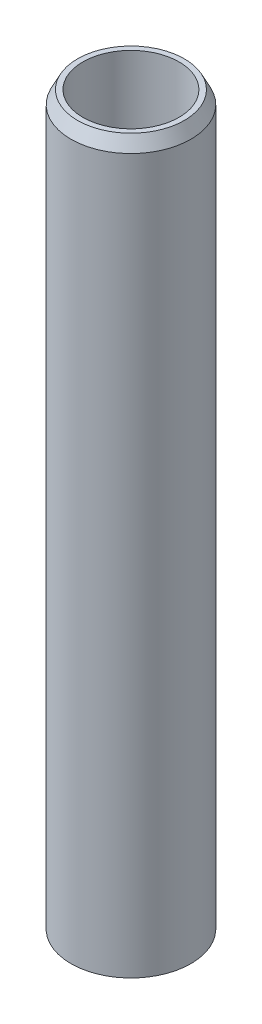
ISO-10303-21;
HEADER;
FILE_DESCRIPTION(('STEP AP214'),'2;1');
FILE_NAME('part.step','',(''),(''),'','','');
FILE_SCHEMA(('AUTOMOTIVE_DESIGN { 1 0 10303 214 1 1 1 1 }'));
ENDSEC;
DATA;
#1=APPLICATION_CONTEXT('core data for automotive mechanical design processes');
#2=APPLICATION_PROTOCOL_DEFINITION('international standard','automotive_design',2000,#1);
#3=PRODUCT_CONTEXT('',#1,'mechanical');
#4=PRODUCT('Part','Part','',(#3));
#5=PRODUCT_RELATED_PRODUCT_CATEGORY('part','',(#4));
#6=PRODUCT_DEFINITION_FORMATION('','',#4);
#7=PRODUCT_DEFINITION_CONTEXT('part definition',#1,'design');
#8=PRODUCT_DEFINITION('design','',#6,#7);
#9=PRODUCT_DEFINITION_SHAPE('','',#8);
#10=(LENGTH_UNIT() NAMED_UNIT(*) SI_UNIT(.MILLI.,.METRE.));
#11=(NAMED_UNIT(*) PLANE_ANGLE_UNIT() SI_UNIT($,.RADIAN.));
#12=(NAMED_UNIT(*) SI_UNIT($,.STERADIAN.) SOLID_ANGLE_UNIT());
#13=UNCERTAINTY_MEASURE_WITH_UNIT(LENGTH_MEASURE(1.E-05),#10,'distance_accuracy_value','');
#14=(GEOMETRIC_REPRESENTATION_CONTEXT(3) GLOBAL_UNCERTAINTY_ASSIGNED_CONTEXT((#13)) GLOBAL_UNIT_ASSIGNED_CONTEXT((#10,
#11,#12)) REPRESENTATION_CONTEXT('',''));
#15=CARTESIAN_POINT('',(0.,0.,0.));
#16=DIRECTION('',(0.,0.,1.));
#17=DIRECTION('',(1.,0.,0.));
#18=AXIS2_PLACEMENT_3D('',#15,#16,#17);
#19=CARTESIAN_POINT('',(0.,305.765995340014,0.));
#20=DIRECTION('',(0.,-1.,0.));
#21=DIRECTION('',(0.,0.,-1.));
#22=AXIS2_PLACEMENT_3D('',#19,#20,#21);
#23=CYLINDRICAL_SURFACE('',#22,25.);
#24=CARTESIAN_POINT('',(0.,300.345094666298,0.));
#25=DIRECTION('',(0.,1.,0.));
#26=DIRECTION('',(0.,0.,1.));
#27=AXIS2_PLACEMENT_3D('',#24,#25,#26);
#28=CIRCLE('',#27,25.);
#29=CARTESIAN_POINT('',(0.,300.345094666298,25.));
#30=VERTEX_POINT('',#29);
#31=EDGE_CURVE('E50',#30,#30,#28,.F.);
#32=ORIENTED_EDGE('',*,*,#31,.T.);
#33=EDGE_LOOP('',(#32));
#34=FACE_BOUND('',#33,.T.);
#35=CARTESIAN_POINT('',(0.,2.73585345812605,0.));
#36=DIRECTION('',(0.,1.,0.));
#37=DIRECTION('',(0.,0.,1.));
#38=AXIS2_PLACEMENT_3D('',#35,#36,#37);
#39=CIRCLE('',#38,25.);
#40=CARTESIAN_POINT('',(0.,2.73585345812605,25.));
#41=VERTEX_POINT('',#40);
#42=EDGE_CURVE('E51',#41,#41,#39,.T.);
#43=ORIENTED_EDGE('',*,*,#42,.T.);
#44=EDGE_LOOP('',(#43));
#45=FACE_BOUND('',#44,.T.);
#46=ADVANCED_FACE('F39',(#34,#45),#23,.T.);
#47=CARTESIAN_POINT('',(0.,305.765995340014,0.));
#48=DIRECTION('',(0.,1.,0.));
#49=DIRECTION('',(0.,0.,1.));
#50=AXIS2_PLACEMENT_3D('',#47,#48,#49);
#51=PLANE('',#50);
#52=CARTESIAN_POINT('',(0.,305.765995340014,0.));
#53=DIRECTION('',(0.,1.,0.));
#54=DIRECTION('',(0.,0.,1.));
#55=AXIS2_PLACEMENT_3D('',#52,#53,#54);
#56=CIRCLE('',#55,22.2641465418739);
#57=CARTESIAN_POINT('',(0.,305.765995340014,22.2641465418739));
#58=VERTEX_POINT('',#57);
#59=EDGE_CURVE('E54',#58,#58,#56,.T.);
#60=ORIENTED_EDGE('',*,*,#59,.T.);
#61=EDGE_LOOP('',(#60));
#62=FACE_BOUND('',#61,.T.);
#63=CARTESIAN_POINT('',(0.,305.765995340014,0.));
#64=DIRECTION('',(0.,1.,0.));
#65=DIRECTION('',(0.,0.,1.));
#66=AXIS2_PLACEMENT_3D('',#63,#64,#65);
#67=CIRCLE('',#66,20.0430833670544);
#68=CARTESIAN_POINT('',(0.,305.765995340014,20.0430833670544));
#69=VERTEX_POINT('',#68);
#70=EDGE_CURVE('E58',#69,#69,#67,.T.);
#71=ORIENTED_EDGE('',*,*,#70,.F.);
#72=EDGE_LOOP('',(#71));
#73=FACE_BOUND('',#72,.T.);
#74=ADVANCED_FACE('F68',(#62,#73),#51,.T.);
#75=CARTESIAN_POINT('',(0.,305.765995340014,0.));
#76=DIRECTION('',(0.,-1.,0.));
#77=DIRECTION('',(0.,0.,-1.));
#78=AXIS2_PLACEMENT_3D('',#75,#76,#77);
#79=CYLINDRICAL_SURFACE('',#78,20.0430833670544);
#80=CARTESIAN_POINT('',(0.,0.234166316422996,0.));
#81=DIRECTION('',(0.,1.,0.));
#82=DIRECTION('',(0.,0.,1.));
#83=AXIS2_PLACEMENT_3D('',#80,#81,#82);
#84=CIRCLE('',#83,20.0430833670544);
#85=CARTESIAN_POINT('',(0.,0.234166316422996,20.0430833670544));
#86=VERTEX_POINT('',#85);
#87=EDGE_CURVE('E10',#86,#86,#84,.F.);
#88=ORIENTED_EDGE('',*,*,#87,.T.);
#89=EDGE_LOOP('',(#88));
#90=FACE_BOUND('',#89,.T.);
#91=ORIENTED_EDGE('',*,*,#70,.T.);
#92=EDGE_LOOP('',(#91));
#93=FACE_BOUND('',#92,.T.);
#94=ADVANCED_FACE('F62',(#90,#93),#79,.F.);
#95=CARTESIAN_POINT('',(0.,305.765995340014,0.));
#96=DIRECTION('',(0.,-1.,0.));
#97=DIRECTION('',(0.,0.,-1.));
#98=AXIS2_PLACEMENT_3D('',#95,#96,#97);
#99=CONICAL_SURFACE('',#98,22.2641465418739,0.467389492716228);
#100=ORIENTED_EDGE('',*,*,#31,.F.);
#101=EDGE_LOOP('',(#100));
#102=FACE_BOUND('',#101,.T.);
#103=ORIENTED_EDGE('',*,*,#59,.F.);
#104=EDGE_LOOP('',(#103));
#105=FACE_BOUND('',#104,.T.);
#106=ADVANCED_FACE('F74',(#102,#105),#99,.T.);
#107=CARTESIAN_POINT('',(0.,2.73585345812605,0.));
#108=DIRECTION('',(0.,1.,0.));
#109=DIRECTION('',(0.,0.,1.));
#110=AXIS2_PLACEMENT_3D('',#107,#108,#109);
#111=CONICAL_SURFACE('',#110,25.,1.10340683407867);
#112=ORIENTED_EDGE('',*,*,#87,.F.);
#113=EDGE_LOOP('',(#112));
#114=FACE_BOUND('',#113,.T.);
#115=ORIENTED_EDGE('',*,*,#42,.F.);
#116=EDGE_LOOP('',(#115));
#117=FACE_BOUND('',#116,.T.);
#118=ADVANCED_FACE('F45',(#114,#117),#111,.T.);
#119=CLOSED_SHELL('',(#46,#74,#94,#106,#118));
#120=MANIFOLD_SOLID_BREP('B2',#119);
#121=ADVANCED_BREP_SHAPE_REPRESENTATION('',(#18,#120),#14);
#122=SHAPE_DEFINITION_REPRESENTATION(#9,#121);
ENDSEC;
END-ISO-10303-21;
